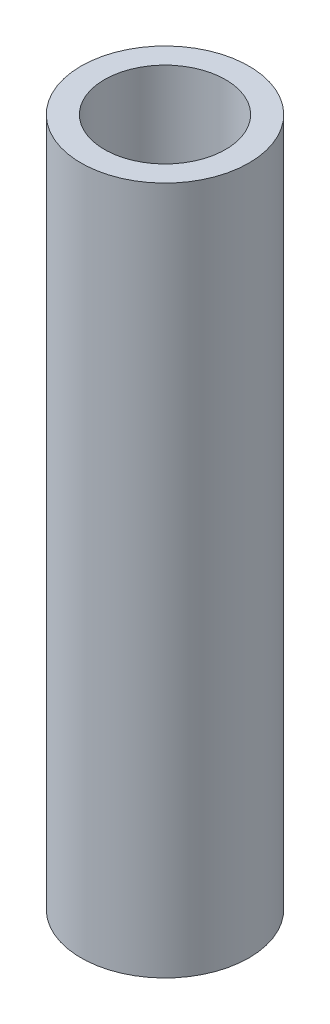
ISO-10303-21;
HEADER;
FILE_DESCRIPTION(('STEP AP214'),'2;1');
FILE_NAME('part.step','',(''),(''),'','','');
FILE_SCHEMA(('AUTOMOTIVE_DESIGN { 1 0 10303 214 1 1 1 1 }'));
ENDSEC;
DATA;
#1=APPLICATION_CONTEXT('core data for automotive mechanical design processes');
#2=APPLICATION_PROTOCOL_DEFINITION('international standard','automotive_design',2000,#1);
#3=PRODUCT_CONTEXT('',#1,'mechanical');
#4=PRODUCT('Part','Part','',(#3));
#5=PRODUCT_RELATED_PRODUCT_CATEGORY('part','',(#4));
#6=PRODUCT_DEFINITION_FORMATION('','',#4);
#7=PRODUCT_DEFINITION_CONTEXT('part definition',#1,'design');
#8=PRODUCT_DEFINITION('design','',#6,#7);
#9=PRODUCT_DEFINITION_SHAPE('','',#8);
#10=(LENGTH_UNIT() NAMED_UNIT(*) SI_UNIT(.MILLI.,.METRE.));
#11=(NAMED_UNIT(*) PLANE_ANGLE_UNIT() SI_UNIT($,.RADIAN.));
#12=(NAMED_UNIT(*) SI_UNIT($,.STERADIAN.) SOLID_ANGLE_UNIT());
#13=UNCERTAINTY_MEASURE_WITH_UNIT(LENGTH_MEASURE(1.E-05),#10,'distance_accuracy_value','');
#14=(GEOMETRIC_REPRESENTATION_CONTEXT(3) GLOBAL_UNCERTAINTY_ASSIGNED_CONTEXT((#13)) GLOBAL_UNIT_ASSIGNED_CONTEXT((#10,
#11,#12)) REPRESENTATION_CONTEXT('',''));
#15=CARTESIAN_POINT('',(0.,0.,0.));
#16=DIRECTION('',(0.,0.,1.));
#17=DIRECTION('',(1.,0.,0.));
#18=AXIS2_PLACEMENT_3D('',#15,#16,#17);
#19=CARTESIAN_POINT('',(-15.25,62.5,0.));
#20=DIRECTION('',(0.,1.,0.));
#21=DIRECTION('',(-1.,0.,0.));
#22=AXIS2_PLACEMENT_3D('',#19,#20,#21);
#23=PLANE('',#22);
#24=CARTESIAN_POINT('',(0.,62.5,0.));
#25=DIRECTION('',(0.,1.,0.));
#26=DIRECTION('',(-1.,0.,0.));
#27=AXIS2_PLACEMENT_3D('',#24,#25,#26);
#28=CIRCLE('',#27,15.25);
#29=CARTESIAN_POINT('',(-15.25,62.5,0.));
#30=VERTEX_POINT('',#29);
#31=EDGE_CURVE('E47',#30,#30,#28,.T.);
#32=ORIENTED_EDGE('',*,*,#31,.T.);
#33=EDGE_LOOP('',(#32));
#34=FACE_BOUND('',#33,.T.);
#35=CARTESIAN_POINT('',(0.,62.5,0.));
#36=DIRECTION('',(0.,1.,0.));
#37=DIRECTION('',(-1.,0.,0.));
#38=AXIS2_PLACEMENT_3D('',#35,#36,#37);
#39=CIRCLE('',#38,11.);
#40=CARTESIAN_POINT('',(-11.,62.5,0.));
#41=VERTEX_POINT('',#40);
#42=EDGE_CURVE('E10',#41,#41,#39,.T.);
#43=ORIENTED_EDGE('',*,*,#42,.F.);
#44=EDGE_LOOP('',(#43));
#45=FACE_BOUND('',#44,.T.);
#46=ADVANCED_FACE('F33',(#34,#45),#23,.T.);
#47=CARTESIAN_POINT('',(0.,83.18345323741,0.));
#48=DIRECTION('',(0.,1.,0.));
#49=DIRECTION('',(-1.,0.,0.));
#50=AXIS2_PLACEMENT_3D('',#47,#48,#49);
#51=CYLINDRICAL_SURFACE('',#50,11.);
#52=ORIENTED_EDGE('',*,*,#42,.T.);
#53=EDGE_LOOP('',(#52));
#54=FACE_BOUND('',#53,.T.);
#55=CARTESIAN_POINT('',(0.,-62.5,0.));
#56=DIRECTION('',(0.,1.,0.));
#57=DIRECTION('',(-1.,0.,0.));
#58=AXIS2_PLACEMENT_3D('',#55,#56,#57);
#59=CIRCLE('',#58,11.);
#60=CARTESIAN_POINT('',(-11.,-62.5,0.));
#61=VERTEX_POINT('',#60);
#62=EDGE_CURVE('E39',#61,#61,#59,.T.);
#63=ORIENTED_EDGE('',*,*,#62,.F.);
#64=EDGE_LOOP('',(#63));
#65=FACE_BOUND('',#64,.T.);
#66=ADVANCED_FACE('F63',(#54,#65),#51,.F.);
#67=CARTESIAN_POINT('',(-15.25,-62.5,0.));
#68=DIRECTION('',(0.,-1.,0.));
#69=DIRECTION('',(1.,0.,0.));
#70=AXIS2_PLACEMENT_3D('',#67,#68,#69);
#71=PLANE('',#70);
#72=ORIENTED_EDGE('',*,*,#62,.T.);
#73=EDGE_LOOP('',(#72));
#74=FACE_BOUND('',#73,.T.);
#75=CARTESIAN_POINT('',(0.,-62.5,0.));
#76=DIRECTION('',(0.,1.,0.));
#77=DIRECTION('',(-1.,0.,0.));
#78=AXIS2_PLACEMENT_3D('',#75,#76,#77);
#79=CIRCLE('',#78,15.25);
#80=CARTESIAN_POINT('',(-15.25,-62.5,0.));
#81=VERTEX_POINT('',#80);
#82=EDGE_CURVE('E43',#81,#81,#79,.T.);
#83=ORIENTED_EDGE('',*,*,#82,.F.);
#84=EDGE_LOOP('',(#83));
#85=FACE_BOUND('',#84,.T.);
#86=ADVANCED_FACE('F57',(#74,#85),#71,.T.);
#87=CARTESIAN_POINT('',(0.,83.18345323741,0.));
#88=DIRECTION('',(0.,1.,0.));
#89=DIRECTION('',(-1.,0.,0.));
#90=AXIS2_PLACEMENT_3D('',#87,#88,#89);
#91=CYLINDRICAL_SURFACE('',#90,15.25);
#92=ORIENTED_EDGE('',*,*,#82,.T.);
#93=EDGE_LOOP('',(#92));
#94=FACE_BOUND('',#93,.T.);
#95=ORIENTED_EDGE('',*,*,#31,.F.);
#96=EDGE_LOOP('',(#95));
#97=FACE_BOUND('',#96,.T.);
#98=ADVANCED_FACE('F55',(#94,#97),#91,.T.);
#99=CLOSED_SHELL('',(#46,#66,#86,#98));
#100=MANIFOLD_SOLID_BREP('B2',#99);
#101=ADVANCED_BREP_SHAPE_REPRESENTATION('',(#18,#100),#14);
#102=SHAPE_DEFINITION_REPRESENTATION(#9,#101);
ENDSEC;
END-ISO-10303-21;
